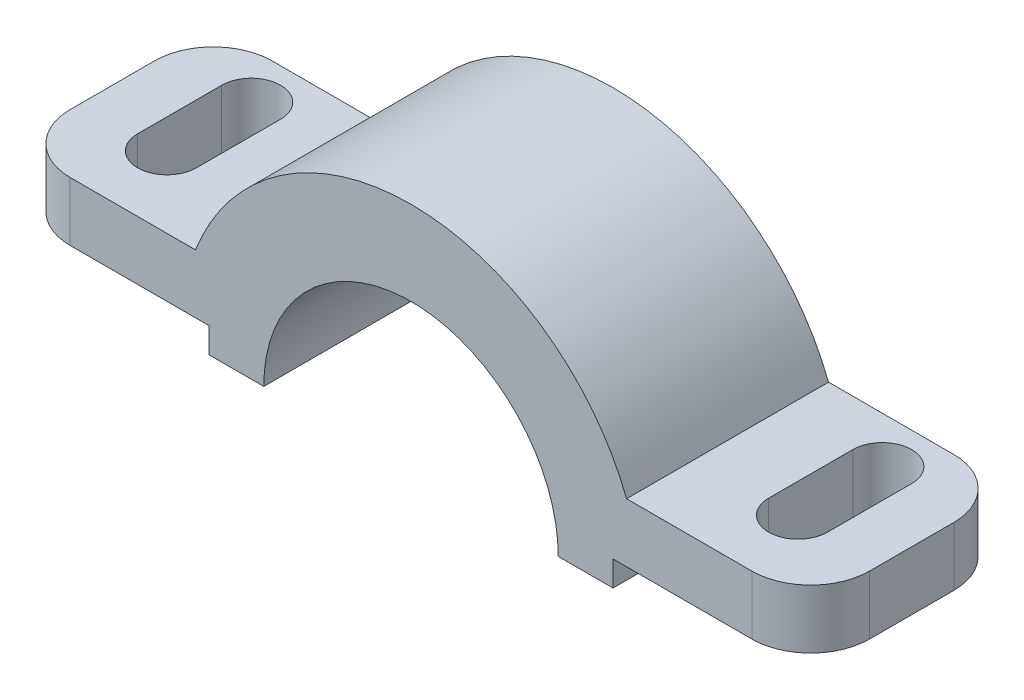
ISO-10303-21;
HEADER;
FILE_DESCRIPTION(('STEP AP214'),'2;1');
FILE_NAME('part.step','',(''),(''),'','','');
FILE_SCHEMA(('AUTOMOTIVE_DESIGN { 1 0 10303 214 1 1 1 1 }'));
ENDSEC;
DATA;
#1=APPLICATION_CONTEXT('core data for automotive mechanical design processes');
#2=APPLICATION_PROTOCOL_DEFINITION('international standard','automotive_design',2000,#1);
#3=PRODUCT_CONTEXT('',#1,'mechanical');
#4=PRODUCT('Part','Part','',(#3));
#5=PRODUCT_RELATED_PRODUCT_CATEGORY('part','',(#4));
#6=PRODUCT_DEFINITION_FORMATION('','',#4);
#7=PRODUCT_DEFINITION_CONTEXT('part definition',#1,'design');
#8=PRODUCT_DEFINITION('design','',#6,#7);
#9=PRODUCT_DEFINITION_SHAPE('','',#8);
#10=(LENGTH_UNIT() NAMED_UNIT(*) SI_UNIT(.MILLI.,.METRE.));
#11=(NAMED_UNIT(*) PLANE_ANGLE_UNIT() SI_UNIT($,.RADIAN.));
#12=(NAMED_UNIT(*) SI_UNIT($,.STERADIAN.) SOLID_ANGLE_UNIT());
#13=UNCERTAINTY_MEASURE_WITH_UNIT(LENGTH_MEASURE(1.E-05),#10,'distance_accuracy_value','');
#14=(GEOMETRIC_REPRESENTATION_CONTEXT(3) GLOBAL_UNCERTAINTY_ASSIGNED_CONTEXT((#13)) GLOBAL_UNIT_ASSIGNED_CONTEXT((#10,
#11,#12)) REPRESENTATION_CONTEXT('',''));
#15=CARTESIAN_POINT('',(0.,0.,0.));
#16=DIRECTION('',(0.,0.,1.));
#17=DIRECTION('',(1.,0.,0.));
#18=AXIS2_PLACEMENT_3D('',#15,#16,#17);
#19=CARTESIAN_POINT('',(-94.9999999999997,5.99999999999999,24.));
#20=DIRECTION('',(1.,0.,0.));
#21=DIRECTION('',(0.,1.,0.));
#22=AXIS2_PLACEMENT_3D('',#19,#20,#21);
#23=PLANE('',#22);
#24=DIRECTION('',(0.,0.,-1.));
#25=VECTOR('',#24,1.);
#26=CARTESIAN_POINT('',(-94.9999999999997,20.,24.));
#27=LINE('',#26,#25);
#28=CARTESIAN_POINT('',(-94.9999999999997,20.,10.));
#29=VERTEX_POINT('',#28);
#30=CARTESIAN_POINT('',(-94.9999999999997,20.,-10.));
#31=VERTEX_POINT('',#30);
#32=EDGE_CURVE('E306',#29,#31,#27,.T.);
#33=ORIENTED_EDGE('',*,*,#32,.T.);
#34=DIRECTION('',(0.,-1.,0.));
#35=VECTOR('',#34,1.);
#36=CARTESIAN_POINT('',(-94.9999999999997,5.99999999999999,-10.));
#37=LINE('',#36,#35);
#38=CARTESIAN_POINT('',(-94.9999999999997,5.99999999999999,-10.));
#39=VERTEX_POINT('',#38);
#40=EDGE_CURVE('E387',#31,#39,#37,.T.);
#41=ORIENTED_EDGE('',*,*,#40,.T.);
#42=DIRECTION('',(0.,0.,-1.));
#43=VECTOR('',#42,1.);
#44=CARTESIAN_POINT('',(-94.9999999999997,5.99999999999999,24.));
#45=LINE('',#44,#43);
#46=CARTESIAN_POINT('',(-94.9999999999997,5.99999999999999,10.));
#47=VERTEX_POINT('',#46);
#48=EDGE_CURVE('E359',#47,#39,#45,.T.);
#49=ORIENTED_EDGE('',*,*,#48,.F.);
#50=DIRECTION('',(0.,-1.,0.));
#51=VECTOR('',#50,1.);
#52=CARTESIAN_POINT('',(-94.9999999999997,5.99999999999999,10.));
#53=LINE('',#52,#51);
#54=EDGE_CURVE('E385',#47,#29,#53,.F.);
#55=ORIENTED_EDGE('',*,*,#54,.T.);
#56=EDGE_LOOP('',(#33,#41,#49,#55));
#57=FACE_BOUND('',#56,.T.);
#58=ADVANCED_FACE('F40',(#57),#23,.F.);
#59=CARTESIAN_POINT('',(-48.0000000000003,6.,24.));
#60=DIRECTION('',(0.,1.,0.));
#61=DIRECTION('',(-1.,0.,0.));
#62=AXIS2_PLACEMENT_3D('',#59,#60,#61);
#63=PLANE('',#62);
#64=DIRECTION('',(0.,0.,1.));
#65=VECTOR('',#64,1.);
#66=CARTESIAN_POINT('',(-82.0000000000004,6.,24.));
#67=LINE('',#66,#65);
#68=CARTESIAN_POINT('',(-82.0000000000004,6.,-13.));
#69=VERTEX_POINT('',#68);
#70=CARTESIAN_POINT('',(-82.0000000000004,6.,7.));
#71=VERTEX_POINT('',#70);
#72=EDGE_CURVE('E267',#69,#71,#67,.T.);
#73=ORIENTED_EDGE('',*,*,#72,.T.);
#74=CARTESIAN_POINT('',(-75.0000000000004,6.,7.));
#75=DIRECTION('',(0.,1.,0.));
#76=DIRECTION('',(-1.,0.,0.));
#77=AXIS2_PLACEMENT_3D('',#74,#75,#76);
#78=CIRCLE('',#77,6.99999999999999);
#79=CARTESIAN_POINT('',(-68.0000000000004,6.,7.));
#80=VERTEX_POINT('',#79);
#81=EDGE_CURVE('E270',#71,#80,#78,.T.);
#82=ORIENTED_EDGE('',*,*,#81,.T.);
#83=DIRECTION('',(0.,0.,-1.));
#84=VECTOR('',#83,1.);
#85=CARTESIAN_POINT('',(-68.0000000000004,6.,24.));
#86=LINE('',#85,#84);
#87=CARTESIAN_POINT('',(-68.0000000000004,6.,-13.));
#88=VERTEX_POINT('',#87);
#89=EDGE_CURVE('E253',#80,#88,#86,.T.);
#90=ORIENTED_EDGE('',*,*,#89,.T.);
#91=CARTESIAN_POINT('',(-75.0000000000004,6.,-13.));
#92=DIRECTION('',(0.,1.,0.));
#93=DIRECTION('',(-1.,0.,0.));
#94=AXIS2_PLACEMENT_3D('',#91,#92,#93);
#95=CIRCLE('',#94,7.);
#96=EDGE_CURVE('E215',#88,#69,#95,.T.);
#97=ORIENTED_EDGE('',*,*,#96,.T.);
#98=EDGE_LOOP('',(#73,#82,#90,#97));
#99=FACE_BOUND('',#98,.T.);
#100=ORIENTED_EDGE('',*,*,#48,.T.);
#101=CARTESIAN_POINT('',(-80.9999999999997,6.,-10.));
#102=DIRECTION('',(0.,1.,0.));
#103=DIRECTION('',(-1.,0.,0.));
#104=AXIS2_PLACEMENT_3D('',#101,#102,#103);
#105=CIRCLE('',#104,14.);
#106=CARTESIAN_POINT('',(-80.9999999999997,6.,-24.));
#107=VERTEX_POINT('',#106);
#108=EDGE_CURVE('E392',#39,#107,#105,.F.);
#109=ORIENTED_EDGE('',*,*,#108,.T.);
#110=DIRECTION('',(1.,0.,0.));
#111=VECTOR('',#110,1.);
#112=CARTESIAN_POINT('',(-48.0000000000003,6.,-24.));
#113=LINE('',#112,#111);
#114=CARTESIAN_POINT('',(-48.0000000000003,6.,-24.));
#115=VERTEX_POINT('',#114);
#116=EDGE_CURVE('E282',#107,#115,#113,.T.);
#117=ORIENTED_EDGE('',*,*,#116,.T.);
#118=DIRECTION('',(0.,0.,-1.));
#119=VECTOR('',#118,1.);
#120=CARTESIAN_POINT('',(-48.0000000000003,6.,24.));
#121=LINE('',#120,#119);
#122=CARTESIAN_POINT('',(-48.0000000000003,6.,24.));
#123=VERTEX_POINT('',#122);
#124=EDGE_CURVE('E356',#123,#115,#121,.T.);
#125=ORIENTED_EDGE('',*,*,#124,.F.);
#126=DIRECTION('',(1.,0.,0.));
#127=VECTOR('',#126,1.);
#128=CARTESIAN_POINT('',(-48.0000000000003,6.,24.));
#129=LINE('',#128,#127);
#130=CARTESIAN_POINT('',(-80.9999999999997,6.,24.));
#131=VERTEX_POINT('',#130);
#132=EDGE_CURVE('E283',#131,#123,#129,.T.);
#133=ORIENTED_EDGE('',*,*,#132,.F.);
#134=CARTESIAN_POINT('',(-80.9999999999997,6.,10.));
#135=DIRECTION('',(0.,1.,0.));
#136=DIRECTION('',(-1.,0.,0.));
#137=AXIS2_PLACEMENT_3D('',#134,#135,#136);
#138=CIRCLE('',#137,14.);
#139=EDGE_CURVE('E390',#131,#47,#138,.F.);
#140=ORIENTED_EDGE('',*,*,#139,.T.);
#141=EDGE_LOOP('',(#100,#109,#117,#125,#133,#140));
#142=FACE_BOUND('',#141,.T.);
#143=ADVANCED_FACE('F408',(#99,#142),#63,.F.);
#144=CARTESIAN_POINT('',(-48.0000000000003,0.,24.));
#145=DIRECTION('',(1.,0.,0.));
#146=DIRECTION('',(0.,0.,-1.));
#147=AXIS2_PLACEMENT_3D('',#144,#145,#146);
#148=PLANE('',#147);
#149=DIRECTION('',(0.,-1.,0.));
#150=VECTOR('',#149,1.);
#151=CARTESIAN_POINT('',(-48.0000000000003,0.,-24.));
#152=LINE('',#151,#150);
#153=CARTESIAN_POINT('',(-48.0000000000003,0.,-24.));
#154=VERTEX_POINT('',#153);
#155=EDGE_CURVE('E308',#115,#154,#152,.T.);
#156=ORIENTED_EDGE('',*,*,#155,.T.);
#157=DIRECTION('',(0.,0.,-1.));
#158=VECTOR('',#157,1.);
#159=CARTESIAN_POINT('',(-48.0000000000003,0.,24.));
#160=LINE('',#159,#158);
#161=CARTESIAN_POINT('',(-48.0000000000003,0.,24.));
#162=VERTEX_POINT('',#161);
#163=EDGE_CURVE('E353',#162,#154,#160,.T.);
#164=ORIENTED_EDGE('',*,*,#163,.F.);
#165=DIRECTION('',(0.,-1.,0.));
#166=VECTOR('',#165,1.);
#167=CARTESIAN_POINT('',(-48.0000000000003,0.,24.));
#168=LINE('',#167,#166);
#169=EDGE_CURVE('E285',#123,#162,#168,.T.);
#170=ORIENTED_EDGE('',*,*,#169,.F.);
#171=ORIENTED_EDGE('',*,*,#124,.T.);
#172=EDGE_LOOP('',(#156,#164,#170,#171));
#173=FACE_BOUND('',#172,.T.);
#174=ADVANCED_FACE('F418',(#173),#148,.F.);
#175=CARTESIAN_POINT('',(-35.0000000000003,0.,24.));
#176=DIRECTION('',(0.,1.,0.));
#177=DIRECTION('',(0.,0.,1.));
#178=AXIS2_PLACEMENT_3D('',#175,#176,#177);
#179=PLANE('',#178);
#180=DIRECTION('',(1.,0.,0.));
#181=VECTOR('',#180,1.);
#182=CARTESIAN_POINT('',(-35.0000000000003,0.,-24.));
#183=LINE('',#182,#181);
#184=CARTESIAN_POINT('',(-35.0000000000003,0.,-24.));
#185=VERTEX_POINT('',#184);
#186=EDGE_CURVE('E310',#154,#185,#183,.T.);
#187=ORIENTED_EDGE('',*,*,#186,.T.);
#188=DIRECTION('',(0.,0.,-1.));
#189=VECTOR('',#188,1.);
#190=CARTESIAN_POINT('',(-35.0000000000003,0.,24.));
#191=LINE('',#190,#189);
#192=CARTESIAN_POINT('',(-35.0000000000003,0.,24.));
#193=VERTEX_POINT('',#192);
#194=EDGE_CURVE('E350',#193,#185,#191,.T.);
#195=ORIENTED_EDGE('',*,*,#194,.F.);
#196=DIRECTION('',(1.,0.,0.));
#197=VECTOR('',#196,1.);
#198=CARTESIAN_POINT('',(-35.0000000000003,0.,24.));
#199=LINE('',#198,#197);
#200=EDGE_CURVE('E288',#162,#193,#199,.T.);
#201=ORIENTED_EDGE('',*,*,#200,.F.);
#202=ORIENTED_EDGE('',*,*,#163,.T.);
#203=EDGE_LOOP('',(#187,#195,#201,#202));
#204=FACE_BOUND('',#203,.T.);
#205=ADVANCED_FACE('F422',(#204),#179,.F.);
#206=CARTESIAN_POINT('',(0.,0.,24.));
#207=DIRECTION('',(0.,0.,-1.));
#208=DIRECTION('',(-1.,0.,0.));
#209=AXIS2_PLACEMENT_3D('',#206,#207,#208);
#210=CYLINDRICAL_SURFACE('',#209,35.0000000000003);
#211=CARTESIAN_POINT('',(0.,0.,-24.));
#212=DIRECTION('',(0.,0.,-1.));
#213=DIRECTION('',(-1.,0.,0.));
#214=AXIS2_PLACEMENT_3D('',#211,#212,#213);
#215=CIRCLE('',#214,35.0000000000003);
#216=CARTESIAN_POINT('',(35.0000000000003,0.,-24.));
#217=VERTEX_POINT('',#216);
#218=EDGE_CURVE('E312',#185,#217,#215,.T.);
#219=ORIENTED_EDGE('',*,*,#218,.T.);
#220=DIRECTION('',(0.,0.,-1.));
#221=VECTOR('',#220,1.);
#222=CARTESIAN_POINT('',(35.0000000000003,0.,24.));
#223=LINE('',#222,#221);
#224=CARTESIAN_POINT('',(35.0000000000003,0.,24.));
#225=VERTEX_POINT('',#224);
#226=EDGE_CURVE('E347',#225,#217,#223,.T.);
#227=ORIENTED_EDGE('',*,*,#226,.F.);
#228=CARTESIAN_POINT('',(0.,0.,24.));
#229=DIRECTION('',(0.,0.,-1.));
#230=DIRECTION('',(-1.,0.,0.));
#231=AXIS2_PLACEMENT_3D('',#228,#229,#230);
#232=CIRCLE('',#231,35.0000000000003);
#233=EDGE_CURVE('E290',#193,#225,#232,.T.);
#234=ORIENTED_EDGE('',*,*,#233,.F.);
#235=ORIENTED_EDGE('',*,*,#194,.T.);
#236=EDGE_LOOP('',(#219,#227,#234,#235));
#237=FACE_BOUND('',#236,.T.);
#238=ADVANCED_FACE('F468',(#237),#210,.F.);
#239=CARTESIAN_POINT('',(35.0000000000003,0.,24.));
#240=DIRECTION('',(0.,1.,0.));
#241=DIRECTION('',(0.,0.,1.));
#242=AXIS2_PLACEMENT_3D('',#239,#240,#241);
#243=PLANE('',#242);
#244=DIRECTION('',(1.,0.,0.));
#245=VECTOR('',#244,1.);
#246=CARTESIAN_POINT('',(35.0000000000003,0.,-24.));
#247=LINE('',#246,#245);
#248=CARTESIAN_POINT('',(48.0000000000003,0.,-24.));
#249=VERTEX_POINT('',#248);
#250=EDGE_CURVE('E314',#217,#249,#247,.T.);
#251=ORIENTED_EDGE('',*,*,#250,.T.);
#252=DIRECTION('',(0.,0.,-1.));
#253=VECTOR('',#252,1.);
#254=CARTESIAN_POINT('',(48.0000000000003,0.,24.));
#255=LINE('',#254,#253);
#256=CARTESIAN_POINT('',(48.0000000000003,0.,24.));
#257=VERTEX_POINT('',#256);
#258=EDGE_CURVE('E344',#257,#249,#255,.T.);
#259=ORIENTED_EDGE('',*,*,#258,.F.);
#260=DIRECTION('',(1.,0.,0.));
#261=VECTOR('',#260,1.);
#262=CARTESIAN_POINT('',(35.0000000000003,0.,24.));
#263=LINE('',#262,#261);
#264=EDGE_CURVE('E292',#225,#257,#263,.T.);
#265=ORIENTED_EDGE('',*,*,#264,.F.);
#266=ORIENTED_EDGE('',*,*,#226,.T.);
#267=EDGE_LOOP('',(#251,#259,#265,#266));
#268=FACE_BOUND('',#267,.T.);
#269=ADVANCED_FACE('F466',(#268),#243,.F.);
#270=CARTESIAN_POINT('',(48.0000000000003,0.,24.));
#271=DIRECTION('',(-1.,0.,0.));
#272=DIRECTION('',(0.,0.,1.));
#273=AXIS2_PLACEMENT_3D('',#270,#271,#272);
#274=PLANE('',#273);
#275=DIRECTION('',(0.,1.,0.));
#276=VECTOR('',#275,1.);
#277=CARTESIAN_POINT('',(48.0000000000003,0.,-24.));
#278=LINE('',#277,#276);
#279=CARTESIAN_POINT('',(48.0000000000003,6.,-24.));
#280=VERTEX_POINT('',#279);
#281=EDGE_CURVE('E316',#249,#280,#278,.T.);
#282=ORIENTED_EDGE('',*,*,#281,.T.);
#283=DIRECTION('',(0.,0.,-1.));
#284=VECTOR('',#283,1.);
#285=CARTESIAN_POINT('',(48.0000000000003,6.,24.));
#286=LINE('',#285,#284);
#287=CARTESIAN_POINT('',(48.0000000000003,6.,24.));
#288=VERTEX_POINT('',#287);
#289=EDGE_CURVE('E341',#288,#280,#286,.T.);
#290=ORIENTED_EDGE('',*,*,#289,.F.);
#291=DIRECTION('',(0.,1.,0.));
#292=VECTOR('',#291,1.);
#293=CARTESIAN_POINT('',(48.0000000000003,0.,24.));
#294=LINE('',#293,#292);
#295=EDGE_CURVE('E294',#257,#288,#294,.T.);
#296=ORIENTED_EDGE('',*,*,#295,.F.);
#297=ORIENTED_EDGE('',*,*,#258,.T.);
#298=EDGE_LOOP('',(#282,#290,#296,#297));
#299=FACE_BOUND('',#298,.T.);
#300=ADVANCED_FACE('F462',(#299),#274,.F.);
#301=CARTESIAN_POINT('',(48.0000000000003,6.,24.));
#302=DIRECTION('',(0.,1.,0.));
#303=DIRECTION('',(-1.,0.,0.));
#304=AXIS2_PLACEMENT_3D('',#301,#302,#303);
#305=PLANE('',#304);
#306=DIRECTION('',(0.,0.,1.));
#307=VECTOR('',#306,1.);
#308=CARTESIAN_POINT('',(68.0000000000002,6.00000000000001,24.));
#309=LINE('',#308,#307);
#310=CARTESIAN_POINT('',(68.0000000000002,6.00000000000001,-13.));
#311=VERTEX_POINT('',#310);
#312=CARTESIAN_POINT('',(68.0000000000002,6.00000000000001,7.));
#313=VERTEX_POINT('',#312);
#314=EDGE_CURVE('E279',#311,#313,#309,.T.);
#315=ORIENTED_EDGE('',*,*,#314,.T.);
#316=CARTESIAN_POINT('',(75.0000000000002,6.00000000000001,7.));
#317=DIRECTION('',(0.,1.,0.));
#318=DIRECTION('',(-1.,0.,0.));
#319=AXIS2_PLACEMENT_3D('',#316,#317,#318);
#320=CIRCLE('',#319,6.99999999999999);
#321=CARTESIAN_POINT('',(82.0000000000002,6.00000000000001,7.));
#322=VERTEX_POINT('',#321);
#323=EDGE_CURVE('E252',#313,#322,#320,.T.);
#324=ORIENTED_EDGE('',*,*,#323,.T.);
#325=DIRECTION('',(0.,0.,-1.));
#326=VECTOR('',#325,1.);
#327=CARTESIAN_POINT('',(82.0000000000002,6.00000000000001,24.));
#328=LINE('',#327,#326);
#329=CARTESIAN_POINT('',(82.0000000000002,6.00000000000001,-13.));
#330=VERTEX_POINT('',#329);
#331=EDGE_CURVE('E273',#322,#330,#328,.T.);
#332=ORIENTED_EDGE('',*,*,#331,.T.);
#333=CARTESIAN_POINT('',(75.0000000000002,6.00000000000001,-13.));
#334=DIRECTION('',(0.,1.,0.));
#335=DIRECTION('',(-1.,0.,0.));
#336=AXIS2_PLACEMENT_3D('',#333,#334,#335);
#337=CIRCLE('',#336,7.);
#338=EDGE_CURVE('E276',#330,#311,#337,.T.);
#339=ORIENTED_EDGE('',*,*,#338,.T.);
#340=EDGE_LOOP('',(#315,#324,#332,#339));
#341=FACE_BOUND('',#340,.T.);
#342=DIRECTION('',(1.,0.,0.));
#343=VECTOR('',#342,1.);
#344=CARTESIAN_POINT('',(48.0000000000003,6.,-24.));
#345=LINE('',#344,#343);
#346=CARTESIAN_POINT('',(81.0000000000003,6.00000000000001,-24.));
#347=VERTEX_POINT('',#346);
#348=EDGE_CURVE('E318',#280,#347,#345,.T.);
#349=ORIENTED_EDGE('',*,*,#348,.T.);
#350=CARTESIAN_POINT('',(81.0000000000003,6.00000000000001,-10.));
#351=DIRECTION('',(0.,1.,0.));
#352=DIRECTION('',(-1.,0.,0.));
#353=AXIS2_PLACEMENT_3D('',#350,#351,#352);
#354=CIRCLE('',#353,14.);
#355=CARTESIAN_POINT('',(95.0000000000003,6.00000000000002,-10.));
#356=VERTEX_POINT('',#355);
#357=EDGE_CURVE('E377',#347,#356,#354,.F.);
#358=ORIENTED_EDGE('',*,*,#357,.T.);
#359=DIRECTION('',(0.,0.,-1.));
#360=VECTOR('',#359,1.);
#361=CARTESIAN_POINT('',(95.0000000000003,6.00000000000002,24.));
#362=LINE('',#361,#360);
#363=CARTESIAN_POINT('',(95.0000000000003,6.00000000000002,10.));
#364=VERTEX_POINT('',#363);
#365=EDGE_CURVE('E338',#364,#356,#362,.T.);
#366=ORIENTED_EDGE('',*,*,#365,.F.);
#367=CARTESIAN_POINT('',(81.0000000000003,6.00000000000001,10.));
#368=DIRECTION('',(0.,1.,0.));
#369=DIRECTION('',(-1.,0.,0.));
#370=AXIS2_PLACEMENT_3D('',#367,#368,#369);
#371=CIRCLE('',#370,14.);
#372=CARTESIAN_POINT('',(81.0000000000003,6.00000000000001,24.));
#373=VERTEX_POINT('',#372);
#374=EDGE_CURVE('E375',#364,#373,#371,.F.);
#375=ORIENTED_EDGE('',*,*,#374,.T.);
#376=DIRECTION('',(1.,0.,0.));
#377=VECTOR('',#376,1.);
#378=CARTESIAN_POINT('',(48.0000000000003,6.,24.));
#379=LINE('',#378,#377);
#380=EDGE_CURVE('E296',#288,#373,#379,.T.);
#381=ORIENTED_EDGE('',*,*,#380,.F.);
#382=ORIENTED_EDGE('',*,*,#289,.T.);
#383=EDGE_LOOP('',(#349,#358,#366,#375,#381,#382));
#384=FACE_BOUND('',#383,.T.);
#385=ADVANCED_FACE('F447',(#341,#384),#305,.F.);
#386=CARTESIAN_POINT('',(95.0000000000003,6.00000000000002,24.));
#387=DIRECTION('',(-1.,0.,0.));
#388=DIRECTION('',(0.,-1.,0.));
#389=AXIS2_PLACEMENT_3D('',#386,#387,#388);
#390=PLANE('',#389);
#391=ORIENTED_EDGE('',*,*,#365,.T.);
#392=DIRECTION('',(0.,1.,0.));
#393=VECTOR('',#392,1.);
#394=CARTESIAN_POINT('',(95.0000000000003,20.,-10.));
#395=LINE('',#394,#393);
#396=CARTESIAN_POINT('',(95.0000000000003,20.,-10.));
#397=VERTEX_POINT('',#396);
#398=EDGE_CURVE('E364',#356,#397,#395,.T.);
#399=ORIENTED_EDGE('',*,*,#398,.T.);
#400=DIRECTION('',(0.,0.,-1.));
#401=VECTOR('',#400,1.);
#402=CARTESIAN_POINT('',(95.0000000000003,20.,24.));
#403=LINE('',#402,#401);
#404=CARTESIAN_POINT('',(95.0000000000003,20.,10.));
#405=VERTEX_POINT('',#404);
#406=EDGE_CURVE('E335',#405,#397,#403,.T.);
#407=ORIENTED_EDGE('',*,*,#406,.F.);
#408=DIRECTION('',(0.,1.,0.));
#409=VECTOR('',#408,1.);
#410=CARTESIAN_POINT('',(95.0000000000003,6.00000000000002,10.));
#411=LINE('',#410,#409);
#412=EDGE_CURVE('E362',#405,#364,#411,.F.);
#413=ORIENTED_EDGE('',*,*,#412,.T.);
#414=EDGE_LOOP('',(#391,#399,#407,#413));
#415=FACE_BOUND('',#414,.T.);
#416=ADVANCED_FACE('F450',(#415),#390,.F.);
#417=CARTESIAN_POINT('',(95.0000000000003,20.,24.));
#418=DIRECTION('',(0.,-1.,0.));
#419=DIRECTION('',(1.,0.,0.));
#420=AXIS2_PLACEMENT_3D('',#417,#418,#419);
#421=PLANE('',#420);
#422=DIRECTION('',(0.,0.,1.));
#423=VECTOR('',#422,1.);
#424=CARTESIAN_POINT('',(82.0000000000003,20.,24.));
#425=LINE('',#424,#423);
#426=CARTESIAN_POINT('',(82.0000000000003,20.,-13.));
#427=VERTEX_POINT('',#426);
#428=CARTESIAN_POINT('',(82.0000000000003,20.,7.));
#429=VERTEX_POINT('',#428);
#430=EDGE_CURVE('E229',#427,#429,#425,.T.);
#431=ORIENTED_EDGE('',*,*,#430,.T.);
#432=CARTESIAN_POINT('',(75.0000000000003,20.,7.));
#433=DIRECTION('',(0.,-1.,0.));
#434=DIRECTION('',(1.,0.,0.));
#435=AXIS2_PLACEMENT_3D('',#432,#433,#434);
#436=CIRCLE('',#435,6.99999999999999);
#437=CARTESIAN_POINT('',(68.0000000000003,20.,7.));
#438=VERTEX_POINT('',#437);
#439=EDGE_CURVE('E11',#429,#438,#436,.T.);
#440=ORIENTED_EDGE('',*,*,#439,.T.);
#441=DIRECTION('',(0.,0.,-1.));
#442=VECTOR('',#441,1.);
#443=CARTESIAN_POINT('',(68.0000000000003,20.,24.));
#444=LINE('',#443,#442);
#445=CARTESIAN_POINT('',(68.0000000000003,20.,-13.));
#446=VERTEX_POINT('',#445);
#447=EDGE_CURVE('E48',#438,#446,#444,.T.);
#448=ORIENTED_EDGE('',*,*,#447,.T.);
#449=CARTESIAN_POINT('',(75.0000000000003,20.,-13.));
#450=DIRECTION('',(0.,-1.,0.));
#451=DIRECTION('',(1.,0.,0.));
#452=AXIS2_PLACEMENT_3D('',#449,#450,#451);
#453=CIRCLE('',#452,7.);
#454=EDGE_CURVE('E232',#446,#427,#453,.T.);
#455=ORIENTED_EDGE('',*,*,#454,.T.);
#456=EDGE_LOOP('',(#431,#440,#448,#455));
#457=FACE_BOUND('',#456,.T.);
#458=ORIENTED_EDGE('',*,*,#406,.T.);
#459=CARTESIAN_POINT('',(81.0000000000003,20.,-10.));
#460=DIRECTION('',(0.,-1.,0.));
#461=DIRECTION('',(1.,0.,0.));
#462=AXIS2_PLACEMENT_3D('',#459,#460,#461);
#463=CIRCLE('',#462,14.);
#464=CARTESIAN_POINT('',(81.0000000000003,20.,-24.));
#465=VERTEX_POINT('',#464);
#466=EDGE_CURVE('E369',#397,#465,#463,.F.);
#467=ORIENTED_EDGE('',*,*,#466,.T.);
#468=DIRECTION('',(-1.,0.,0.));
#469=VECTOR('',#468,1.);
#470=CARTESIAN_POINT('',(95.0000000000003,20.,-24.));
#471=LINE('',#470,#469);
#472=CARTESIAN_POINT('',(51.2347538297983,19.9999999999999,-24.));
#473=VERTEX_POINT('',#472);
#474=EDGE_CURVE('E321',#465,#473,#471,.T.);
#475=ORIENTED_EDGE('',*,*,#474,.T.);
#476=DIRECTION('',(0.,0.,-1.));
#477=VECTOR('',#476,1.);
#478=CARTESIAN_POINT('',(51.2347538297983,19.9999999999999,24.));
#479=LINE('',#478,#477);
#480=CARTESIAN_POINT('',(51.2347538297983,19.9999999999999,24.));
#481=VERTEX_POINT('',#480);
#482=EDGE_CURVE('E332',#481,#473,#479,.T.);
#483=ORIENTED_EDGE('',*,*,#482,.F.);
#484=DIRECTION('',(-1.,0.,0.));
#485=VECTOR('',#484,1.);
#486=CARTESIAN_POINT('',(95.0000000000003,20.,24.));
#487=LINE('',#486,#485);
#488=CARTESIAN_POINT('',(81.0000000000003,20.,24.));
#489=VERTEX_POINT('',#488);
#490=EDGE_CURVE('E299',#489,#481,#487,.T.);
#491=ORIENTED_EDGE('',*,*,#490,.F.);
#492=CARTESIAN_POINT('',(81.0000000000003,20.,10.));
#493=DIRECTION('',(0.,-1.,0.));
#494=DIRECTION('',(1.,0.,0.));
#495=AXIS2_PLACEMENT_3D('',#492,#493,#494);
#496=CIRCLE('',#495,14.);
#497=EDGE_CURVE('E367',#489,#405,#496,.F.);
#498=ORIENTED_EDGE('',*,*,#497,.T.);
#499=EDGE_LOOP('',(#458,#467,#475,#483,#491,#498));
#500=FACE_BOUND('',#499,.T.);
#501=ADVANCED_FACE('F236',(#457,#500),#421,.F.);
#502=CARTESIAN_POINT('',(0.,0.,24.));
#503=DIRECTION('',(0.,0.,-1.));
#504=DIRECTION('',(-1.,0.,0.));
#505=AXIS2_PLACEMENT_3D('',#502,#503,#504);
#506=CYLINDRICAL_SURFACE('',#505,55.0000000000003);
#507=CARTESIAN_POINT('',(0.,0.,-24.));
#508=DIRECTION('',(0.,0.,1.));
#509=DIRECTION('',(-1.,0.,0.));
#510=AXIS2_PLACEMENT_3D('',#507,#508,#509);
#511=CIRCLE('',#510,55.0000000000003);
#512=CARTESIAN_POINT('',(-51.234753829798,20.,-24.));
#513=VERTEX_POINT('',#512);
#514=EDGE_CURVE('E323',#473,#513,#511,.T.);
#515=ORIENTED_EDGE('',*,*,#514,.T.);
#516=DIRECTION('',(0.,0.,-1.));
#517=VECTOR('',#516,1.);
#518=CARTESIAN_POINT('',(-51.234753829798,20.,24.));
#519=LINE('',#518,#517);
#520=CARTESIAN_POINT('',(-51.234753829798,20.,24.));
#521=VERTEX_POINT('',#520);
#522=EDGE_CURVE('E329',#521,#513,#519,.T.);
#523=ORIENTED_EDGE('',*,*,#522,.F.);
#524=CARTESIAN_POINT('',(0.,0.,24.));
#525=DIRECTION('',(0.,0.,1.));
#526=DIRECTION('',(-1.,0.,0.));
#527=AXIS2_PLACEMENT_3D('',#524,#525,#526);
#528=CIRCLE('',#527,55.0000000000003);
#529=EDGE_CURVE('E301',#481,#521,#528,.T.);
#530=ORIENTED_EDGE('',*,*,#529,.F.);
#531=ORIENTED_EDGE('',*,*,#482,.T.);
#532=EDGE_LOOP('',(#515,#523,#530,#531));
#533=FACE_BOUND('',#532,.T.);
#534=ADVANCED_FACE('F437',(#533),#506,.T.);
#535=CARTESIAN_POINT('',(-94.9999999999997,20.,24.));
#536=DIRECTION('',(0.,-1.,0.));
#537=DIRECTION('',(1.,0.,0.));
#538=AXIS2_PLACEMENT_3D('',#535,#536,#537);
#539=PLANE('',#538);
#540=DIRECTION('',(0.,0.,1.));
#541=VECTOR('',#540,1.);
#542=CARTESIAN_POINT('',(-68.0000000000003,20.,24.));
#543=LINE('',#542,#541);
#544=CARTESIAN_POINT('',(-68.0000000000003,20.,-13.));
#545=VERTEX_POINT('',#544);
#546=CARTESIAN_POINT('',(-68.0000000000003,20.,7.));
#547=VERTEX_POINT('',#546);
#548=EDGE_CURVE('E199',#545,#547,#543,.T.);
#549=ORIENTED_EDGE('',*,*,#548,.T.);
#550=CARTESIAN_POINT('',(-75.0000000000003,20.,7.));
#551=DIRECTION('',(0.,-1.,0.));
#552=DIRECTION('',(1.,0.,0.));
#553=AXIS2_PLACEMENT_3D('',#550,#551,#552);
#554=CIRCLE('',#553,6.99999999999999);
#555=CARTESIAN_POINT('',(-82.0000000000003,20.,7.));
#556=VERTEX_POINT('',#555);
#557=EDGE_CURVE('E224',#547,#556,#554,.T.);
#558=ORIENTED_EDGE('',*,*,#557,.T.);
#559=DIRECTION('',(0.,0.,-1.));
#560=VECTOR('',#559,1.);
#561=CARTESIAN_POINT('',(-82.0000000000003,20.,24.));
#562=LINE('',#561,#560);
#563=CARTESIAN_POINT('',(-82.0000000000003,20.,-13.));
#564=VERTEX_POINT('',#563);
#565=EDGE_CURVE('E222',#556,#564,#562,.T.);
#566=ORIENTED_EDGE('',*,*,#565,.T.);
#567=CARTESIAN_POINT('',(-75.0000000000003,20.,-13.));
#568=DIRECTION('',(0.,-1.,0.));
#569=DIRECTION('',(1.,0.,0.));
#570=AXIS2_PLACEMENT_3D('',#567,#568,#569);
#571=CIRCLE('',#570,7.);
#572=EDGE_CURVE('E207',#564,#545,#571,.T.);
#573=ORIENTED_EDGE('',*,*,#572,.T.);
#574=EDGE_LOOP('',(#549,#558,#566,#573));
#575=FACE_BOUND('',#574,.T.);
#576=DIRECTION('',(-1.,0.,0.));
#577=VECTOR('',#576,1.);
#578=CARTESIAN_POINT('',(-94.9999999999997,20.,-24.));
#579=LINE('',#578,#577);
#580=CARTESIAN_POINT('',(-80.9999999999997,20.,-24.));
#581=VERTEX_POINT('',#580);
#582=EDGE_CURVE('E286',#513,#581,#579,.T.);
#583=ORIENTED_EDGE('',*,*,#582,.T.);
#584=CARTESIAN_POINT('',(-80.9999999999997,20.,-10.));
#585=DIRECTION('',(0.,-1.,0.));
#586=DIRECTION('',(1.,0.,0.));
#587=AXIS2_PLACEMENT_3D('',#584,#585,#586);
#588=CIRCLE('',#587,14.);
#589=EDGE_CURVE('E208',#581,#31,#588,.F.);
#590=ORIENTED_EDGE('',*,*,#589,.T.);
#591=ORIENTED_EDGE('',*,*,#32,.F.);
#592=CARTESIAN_POINT('',(-80.9999999999997,20.,10.));
#593=DIRECTION('',(0.,-1.,0.));
#594=DIRECTION('',(1.,0.,0.));
#595=AXIS2_PLACEMENT_3D('',#592,#593,#594);
#596=CIRCLE('',#595,14.);
#597=CARTESIAN_POINT('',(-80.9999999999997,20.,24.));
#598=VERTEX_POINT('',#597);
#599=EDGE_CURVE('E394',#29,#598,#596,.F.);
#600=ORIENTED_EDGE('',*,*,#599,.T.);
#601=DIRECTION('',(-1.,0.,0.));
#602=VECTOR('',#601,1.);
#603=CARTESIAN_POINT('',(-94.9999999999997,20.,24.));
#604=LINE('',#603,#602);
#605=EDGE_CURVE('E303',#521,#598,#604,.T.);
#606=ORIENTED_EDGE('',*,*,#605,.F.);
#607=ORIENTED_EDGE('',*,*,#522,.T.);
#608=EDGE_LOOP('',(#583,#590,#591,#600,#606,#607));
#609=FACE_BOUND('',#608,.T.);
#610=ADVANCED_FACE('F220',(#575,#609),#539,.F.);
#611=CARTESIAN_POINT('',(0.,0.,24.));
#612=DIRECTION('',(0.,0.,-1.));
#613=DIRECTION('',(-1.,0.,0.));
#614=AXIS2_PLACEMENT_3D('',#611,#612,#613);
#615=PLANE('',#614);
#616=ORIENTED_EDGE('',*,*,#380,.T.);
#617=DIRECTION('',(0.,1.,0.));
#618=VECTOR('',#617,1.);
#619=CARTESIAN_POINT('',(81.0000000000003,0.,24.));
#620=LINE('',#619,#618);
#621=EDGE_CURVE('E382',#373,#489,#620,.T.);
#622=ORIENTED_EDGE('',*,*,#621,.T.);
#623=ORIENTED_EDGE('',*,*,#490,.T.);
#624=ORIENTED_EDGE('',*,*,#529,.T.);
#625=ORIENTED_EDGE('',*,*,#605,.T.);
#626=DIRECTION('',(0.,-1.,0.));
#627=VECTOR('',#626,1.);
#628=CARTESIAN_POINT('',(-80.9999999999997,0.,24.));
#629=LINE('',#628,#627);
#630=EDGE_CURVE('E379',#598,#131,#629,.T.);
#631=ORIENTED_EDGE('',*,*,#630,.T.);
#632=ORIENTED_EDGE('',*,*,#132,.T.);
#633=ORIENTED_EDGE('',*,*,#169,.T.);
#634=ORIENTED_EDGE('',*,*,#200,.T.);
#635=ORIENTED_EDGE('',*,*,#233,.T.);
#636=ORIENTED_EDGE('',*,*,#264,.T.);
#637=ORIENTED_EDGE('',*,*,#295,.T.);
#638=EDGE_LOOP('',(#616,#622,#623,#624,#625,#631,#632,#633,#634,#635,#636,#637));
#639=FACE_BOUND('',#638,.T.);
#640=ADVANCED_FACE('F426',(#639),#615,.F.);
#641=CARTESIAN_POINT('',(0.,0.,-24.));
#642=DIRECTION('',(0.,0.,-1.));
#643=DIRECTION('',(-1.,0.,0.));
#644=AXIS2_PLACEMENT_3D('',#641,#642,#643);
#645=PLANE('',#644);
#646=ORIENTED_EDGE('',*,*,#474,.F.);
#647=DIRECTION('',(0.,1.,0.));
#648=VECTOR('',#647,1.);
#649=CARTESIAN_POINT('',(81.0000000000003,6.00000000000003,-24.));
#650=LINE('',#649,#648);
#651=EDGE_CURVE('E373',#465,#347,#650,.F.);
#652=ORIENTED_EDGE('',*,*,#651,.T.);
#653=ORIENTED_EDGE('',*,*,#348,.F.);
#654=ORIENTED_EDGE('',*,*,#281,.F.);
#655=ORIENTED_EDGE('',*,*,#250,.F.);
#656=ORIENTED_EDGE('',*,*,#218,.F.);
#657=ORIENTED_EDGE('',*,*,#186,.F.);
#658=ORIENTED_EDGE('',*,*,#155,.F.);
#659=ORIENTED_EDGE('',*,*,#116,.F.);
#660=DIRECTION('',(0.,-1.,0.));
#661=VECTOR('',#660,1.);
#662=CARTESIAN_POINT('',(-80.9999999999997,20.,-24.));
#663=LINE('',#662,#661);
#664=EDGE_CURVE('E371',#107,#581,#663,.F.);
#665=ORIENTED_EDGE('',*,*,#664,.T.);
#666=ORIENTED_EDGE('',*,*,#582,.F.);
#667=ORIENTED_EDGE('',*,*,#514,.F.);
#668=EDGE_LOOP('',(#646,#652,#653,#654,#655,#656,#657,#658,#659,#665,#666,#667));
#669=FACE_BOUND('',#668,.T.);
#670=ADVANCED_FACE('F413',(#669),#645,.T.);
#671=CARTESIAN_POINT('',(81.0000000000003,6.00000000000003,-10.));
#672=DIRECTION('',(0.,-1.,0.));
#673=DIRECTION('',(1.,0.,0.));
#674=AXIS2_PLACEMENT_3D('',#671,#672,#673);
#675=CYLINDRICAL_SURFACE('',#674,14.);
#676=ORIENTED_EDGE('',*,*,#357,.F.);
#677=ORIENTED_EDGE('',*,*,#651,.F.);
#678=ORIENTED_EDGE('',*,*,#466,.F.);
#679=ORIENTED_EDGE('',*,*,#398,.F.);
#680=EDGE_LOOP('',(#676,#677,#678,#679));
#681=FACE_BOUND('',#680,.T.);
#682=ADVANCED_FACE('F443',(#681),#675,.T.);
#683=CARTESIAN_POINT('',(81.0000000000003,0.,10.));
#684=DIRECTION('',(0.,1.,0.));
#685=DIRECTION('',(-1.,0.,0.));
#686=AXIS2_PLACEMENT_3D('',#683,#684,#685);
#687=CYLINDRICAL_SURFACE('',#686,14.);
#688=ORIENTED_EDGE('',*,*,#374,.F.);
#689=ORIENTED_EDGE('',*,*,#412,.F.);
#690=ORIENTED_EDGE('',*,*,#497,.F.);
#691=ORIENTED_EDGE('',*,*,#621,.F.);
#692=EDGE_LOOP('',(#688,#689,#690,#691));
#693=FACE_BOUND('',#692,.T.);
#694=ADVANCED_FACE('F454',(#693),#687,.T.);
#695=CARTESIAN_POINT('',(-80.9999999999997,6.00000000000001,-10.));
#696=DIRECTION('',(0.,1.,0.));
#697=DIRECTION('',(-1.,0.,0.));
#698=AXIS2_PLACEMENT_3D('',#695,#696,#697);
#699=CYLINDRICAL_SURFACE('',#698,14.);
#700=ORIENTED_EDGE('',*,*,#589,.F.);
#701=ORIENTED_EDGE('',*,*,#664,.F.);
#702=ORIENTED_EDGE('',*,*,#108,.F.);
#703=ORIENTED_EDGE('',*,*,#40,.F.);
#704=EDGE_LOOP('',(#700,#701,#702,#703));
#705=FACE_BOUND('',#704,.T.);
#706=ADVANCED_FACE('F405',(#705),#699,.T.);
#707=CARTESIAN_POINT('',(-80.9999999999997,0.,10.));
#708=DIRECTION('',(0.,-1.,0.));
#709=DIRECTION('',(1.,0.,0.));
#710=AXIS2_PLACEMENT_3D('',#707,#708,#709);
#711=CYLINDRICAL_SURFACE('',#710,14.);
#712=ORIENTED_EDGE('',*,*,#599,.F.);
#713=ORIENTED_EDGE('',*,*,#54,.F.);
#714=ORIENTED_EDGE('',*,*,#139,.F.);
#715=ORIENTED_EDGE('',*,*,#630,.F.);
#716=EDGE_LOOP('',(#712,#713,#714,#715));
#717=FACE_BOUND('',#716,.T.);
#718=ADVANCED_FACE('F42',(#717),#711,.T.);
#719=CARTESIAN_POINT('',(-75.0000000000004,-1.04083408558608E-13,7.));
#720=DIRECTION('',(0.,1.,0.));
#721=DIRECTION('',(-1.,0.,0.));
#722=AXIS2_PLACEMENT_3D('',#719,#720,#721);
#723=CYLINDRICAL_SURFACE('',#722,6.99999999999999);
#724=DIRECTION('',(0.,1.,0.));
#725=VECTOR('',#724,1.);
#726=CARTESIAN_POINT('',(-82.0000000000004,0.,7.));
#727=LINE('',#726,#725);
#728=EDGE_CURVE('E261',#71,#556,#727,.T.);
#729=ORIENTED_EDGE('',*,*,#728,.T.);
#730=ORIENTED_EDGE('',*,*,#557,.F.);
#731=DIRECTION('',(0.,1.,0.));
#732=VECTOR('',#731,1.);
#733=CARTESIAN_POINT('',(-68.0000000000004,-1.38777878078145E-13,7.));
#734=LINE('',#733,#732);
#735=EDGE_CURVE('E202',#80,#547,#734,.T.);
#736=ORIENTED_EDGE('',*,*,#735,.F.);
#737=ORIENTED_EDGE('',*,*,#81,.F.);
#738=EDGE_LOOP('',(#729,#730,#736,#737));
#739=FACE_BOUND('',#738,.T.);
#740=ADVANCED_FACE('F493',(#739),#723,.F.);
#741=CARTESIAN_POINT('',(-82.0000000000004,0.,7.));
#742=DIRECTION('',(-1.,0.,0.));
#743=DIRECTION('',(0.,-1.,0.));
#744=AXIS2_PLACEMENT_3D('',#741,#742,#743);
#745=PLANE('',#744);
#746=DIRECTION('',(0.,1.,0.));
#747=VECTOR('',#746,1.);
#748=CARTESIAN_POINT('',(-82.0000000000004,0.,-13.));
#749=LINE('',#748,#747);
#750=EDGE_CURVE('E217',#69,#564,#749,.T.);
#751=ORIENTED_EDGE('',*,*,#750,.T.);
#752=ORIENTED_EDGE('',*,*,#565,.F.);
#753=ORIENTED_EDGE('',*,*,#728,.F.);
#754=ORIENTED_EDGE('',*,*,#72,.F.);
#755=EDGE_LOOP('',(#751,#752,#753,#754));
#756=FACE_BOUND('',#755,.T.);
#757=ADVANCED_FACE('F497',(#756),#745,.F.);
#758=CARTESIAN_POINT('',(-75.0000000000004,-1.04083408558608E-13,-13.));
#759=DIRECTION('',(0.,1.,0.));
#760=DIRECTION('',(-1.,0.,0.));
#761=AXIS2_PLACEMENT_3D('',#758,#759,#760);
#762=CYLINDRICAL_SURFACE('',#761,7.);
#763=DIRECTION('',(0.,1.,0.));
#764=VECTOR('',#763,1.);
#765=CARTESIAN_POINT('',(-68.0000000000004,-1.38777878078145E-13,-13.));
#766=LINE('',#765,#764);
#767=EDGE_CURVE('E55',#88,#545,#766,.T.);
#768=ORIENTED_EDGE('',*,*,#767,.T.);
#769=ORIENTED_EDGE('',*,*,#572,.F.);
#770=ORIENTED_EDGE('',*,*,#750,.F.);
#771=ORIENTED_EDGE('',*,*,#96,.F.);
#772=EDGE_LOOP('',(#768,#769,#770,#771));
#773=FACE_BOUND('',#772,.T.);
#774=ADVANCED_FACE('F211',(#773),#762,.F.);
#775=CARTESIAN_POINT('',(-68.0000000000004,-1.38777878078145E-13,7.));
#776=DIRECTION('',(1.,0.,0.));
#777=DIRECTION('',(0.,1.,0.));
#778=AXIS2_PLACEMENT_3D('',#775,#776,#777);
#779=PLANE('',#778);
#780=ORIENTED_EDGE('',*,*,#735,.T.);
#781=ORIENTED_EDGE('',*,*,#548,.F.);
#782=ORIENTED_EDGE('',*,*,#767,.F.);
#783=ORIENTED_EDGE('',*,*,#89,.F.);
#784=EDGE_LOOP('',(#780,#781,#782,#783));
#785=FACE_BOUND('',#784,.T.);
#786=ADVANCED_FACE('F200',(#785),#779,.F.);
#787=CARTESIAN_POINT('',(75.0000000000002,-8.74300631892311E-13,7.));
#788=DIRECTION('',(0.,1.,0.));
#789=DIRECTION('',(-1.,0.,0.));
#790=AXIS2_PLACEMENT_3D('',#787,#788,#789);
#791=CYLINDRICAL_SURFACE('',#790,6.99999999999999);
#792=DIRECTION('',(0.,1.,0.));
#793=VECTOR('',#792,1.);
#794=CARTESIAN_POINT('',(68.0000000000002,-8.39606162372775E-13,7.));
#795=LINE('',#794,#793);
#796=EDGE_CURVE('E244',#313,#438,#795,.T.);
#797=ORIENTED_EDGE('',*,*,#796,.T.);
#798=ORIENTED_EDGE('',*,*,#439,.F.);
#799=DIRECTION('',(0.,1.,0.));
#800=VECTOR('',#799,1.);
#801=CARTESIAN_POINT('',(82.0000000000002,-9.12464548363801E-13,7.));
#802=LINE('',#801,#800);
#803=EDGE_CURVE('E259',#322,#429,#802,.T.);
#804=ORIENTED_EDGE('',*,*,#803,.F.);
#805=ORIENTED_EDGE('',*,*,#323,.F.);
#806=EDGE_LOOP('',(#797,#798,#804,#805));
#807=FACE_BOUND('',#806,.T.);
#808=ADVANCED_FACE('F249',(#807),#791,.F.);
#809=CARTESIAN_POINT('',(68.0000000000002,-8.39606162372775E-13,7.));
#810=DIRECTION('',(-1.,0.,0.));
#811=DIRECTION('',(0.,-1.,0.));
#812=AXIS2_PLACEMENT_3D('',#809,#810,#811);
#813=PLANE('',#812);
#814=DIRECTION('',(0.,1.,0.));
#815=VECTOR('',#814,1.);
#816=CARTESIAN_POINT('',(68.0000000000002,-8.39606162372775E-13,-13.));
#817=LINE('',#816,#815);
#818=EDGE_CURVE('E247',#311,#446,#817,.T.);
#819=ORIENTED_EDGE('',*,*,#818,.T.);
#820=ORIENTED_EDGE('',*,*,#447,.F.);
#821=ORIENTED_EDGE('',*,*,#796,.F.);
#822=ORIENTED_EDGE('',*,*,#314,.F.);
#823=EDGE_LOOP('',(#819,#820,#821,#822));
#824=FACE_BOUND('',#823,.T.);
#825=ADVANCED_FACE('F243',(#824),#813,.F.);
#826=CARTESIAN_POINT('',(75.0000000000002,-8.74300631892311E-13,-13.));
#827=DIRECTION('',(0.,1.,0.));
#828=DIRECTION('',(-1.,0.,0.));
#829=AXIS2_PLACEMENT_3D('',#826,#827,#828);
#830=CYLINDRICAL_SURFACE('',#829,7.);
#831=DIRECTION('',(0.,1.,0.));
#832=VECTOR('',#831,1.);
#833=CARTESIAN_POINT('',(82.0000000000002,-9.08995101411847E-13,-13.));
#834=LINE('',#833,#832);
#835=EDGE_CURVE('E63',#330,#427,#834,.T.);
#836=ORIENTED_EDGE('',*,*,#835,.T.);
#837=ORIENTED_EDGE('',*,*,#454,.F.);
#838=ORIENTED_EDGE('',*,*,#818,.F.);
#839=ORIENTED_EDGE('',*,*,#338,.F.);
#840=EDGE_LOOP('',(#836,#837,#838,#839));
#841=FACE_BOUND('',#840,.T.);
#842=ADVANCED_FACE('F614',(#841),#830,.F.);
#843=CARTESIAN_POINT('',(82.0000000000002,-9.12464548363801E-13,7.));
#844=DIRECTION('',(1.,0.,0.));
#845=DIRECTION('',(0.,1.,0.));
#846=AXIS2_PLACEMENT_3D('',#843,#844,#845);
#847=PLANE('',#846);
#848=ORIENTED_EDGE('',*,*,#803,.T.);
#849=ORIENTED_EDGE('',*,*,#430,.F.);
#850=ORIENTED_EDGE('',*,*,#835,.F.);
#851=ORIENTED_EDGE('',*,*,#331,.F.);
#852=EDGE_LOOP('',(#848,#849,#850,#851));
#853=FACE_BOUND('',#852,.T.);
#854=ADVANCED_FACE('F623',(#853),#847,.F.);
#855=CLOSED_SHELL('',(#58,#143,#174,#205,#238,#269,#300,#385,#416,#501,#534,#610,#640,#670,#682,
#694,#706,#718,#740,#757,#774,#786,#808,#825,#842,#854));
#856=MANIFOLD_SOLID_BREP('B2',#855);
#857=ADVANCED_BREP_SHAPE_REPRESENTATION('',(#18,#856),#14);
#858=SHAPE_DEFINITION_REPRESENTATION(#9,#857);
ENDSEC;
END-ISO-10303-21;
